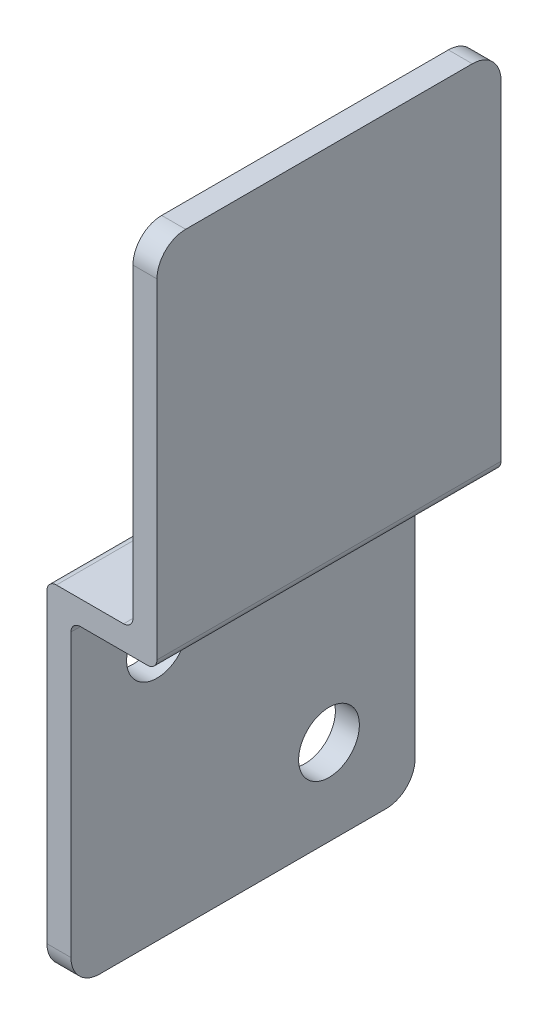
ISO-10303-21;
HEADER;
FILE_DESCRIPTION(('STEP AP214'),'2;1');
FILE_NAME('part.step','',(''),(''),'','','');
FILE_SCHEMA(('AUTOMOTIVE_DESIGN { 1 0 10303 214 1 1 1 1 }'));
ENDSEC;
DATA;
#1=APPLICATION_CONTEXT('core data for automotive mechanical design processes');
#2=APPLICATION_PROTOCOL_DEFINITION('international standard','automotive_design',2000,#1);
#3=PRODUCT_CONTEXT('',#1,'mechanical');
#4=PRODUCT('Part','Part','',(#3));
#5=PRODUCT_RELATED_PRODUCT_CATEGORY('part','',(#4));
#6=PRODUCT_DEFINITION_FORMATION('','',#4);
#7=PRODUCT_DEFINITION_CONTEXT('part definition',#1,'design');
#8=PRODUCT_DEFINITION('design','',#6,#7);
#9=PRODUCT_DEFINITION_SHAPE('','',#8);
#10=(LENGTH_UNIT() NAMED_UNIT(*) SI_UNIT(.MILLI.,.METRE.));
#11=(NAMED_UNIT(*) PLANE_ANGLE_UNIT() SI_UNIT($,.RADIAN.));
#12=(NAMED_UNIT(*) SI_UNIT($,.STERADIAN.) SOLID_ANGLE_UNIT());
#13=UNCERTAINTY_MEASURE_WITH_UNIT(LENGTH_MEASURE(1.E-05),#10,'distance_accuracy_value','');
#14=(GEOMETRIC_REPRESENTATION_CONTEXT(3) GLOBAL_UNCERTAINTY_ASSIGNED_CONTEXT((#13)) GLOBAL_UNIT_ASSIGNED_CONTEXT((#10,
#11,#12)) REPRESENTATION_CONTEXT('',''));
#15=CARTESIAN_POINT('',(0.,0.,0.));
#16=DIRECTION('',(0.,0.,1.));
#17=DIRECTION('',(1.,0.,0.));
#18=AXIS2_PLACEMENT_3D('',#15,#16,#17);
#19=CARTESIAN_POINT('',(0.,0.,-19.05));
#20=DIRECTION('',(0.,-1.,0.));
#21=DIRECTION('',(0.,0.,-1.));
#22=AXIS2_PLACEMENT_3D('',#19,#20,#21);
#23=PLANE('',#22);
#24=DIRECTION('',(0.,0.,-1.));
#25=VECTOR('',#24,1.);
#26=CARTESIAN_POINT('',(2.65684,0.,-19.05));
#27=LINE('',#26,#25);
#28=CARTESIAN_POINT('',(2.65684,0.,15.875));
#29=VERTEX_POINT('',#28);
#30=CARTESIAN_POINT('',(2.65684,0.,-15.875));
#31=VERTEX_POINT('',#30);
#32=EDGE_CURVE('E168',#29,#31,#27,.T.);
#33=ORIENTED_EDGE('',*,*,#32,.F.);
#34=DIRECTION('',(1.,0.,0.));
#35=VECTOR('',#34,1.);
#36=CARTESIAN_POINT('',(-15.880246624,0.,15.875));
#37=LINE('',#36,#35);
#38=CARTESIAN_POINT('',(0.,0.,15.875));
#39=VERTEX_POINT('',#38);
#40=EDGE_CURVE('E197',#39,#29,#37,.T.);
#41=ORIENTED_EDGE('',*,*,#40,.F.);
#42=DIRECTION('',(0.,0.,1.));
#43=VECTOR('',#42,1.);
#44=CARTESIAN_POINT('',(0.,0.,-19.05));
#45=LINE('',#44,#43);
#46=CARTESIAN_POINT('',(0.,0.,-15.875));
#47=VERTEX_POINT('',#46);
#48=EDGE_CURVE('E182',#47,#39,#45,.T.);
#49=ORIENTED_EDGE('',*,*,#48,.F.);
#50=DIRECTION('',(-1.,0.,0.));
#51=VECTOR('',#50,1.);
#52=CARTESIAN_POINT('',(28.062086624,0.,-15.875));
#53=LINE('',#52,#51);
#54=EDGE_CURVE('E194',#31,#47,#53,.T.);
#55=ORIENTED_EDGE('',*,*,#54,.F.);
#56=EDGE_LOOP('',(#33,#41,#49,#55));
#57=FACE_BOUND('',#56,.T.);
#58=ADVANCED_FACE('F17',(#57),#23,.T.);
#59=CARTESIAN_POINT('',(2.65684,9.525,-9.525));
#60=DIRECTION('',(1.,0.,0.));
#61=DIRECTION('',(0.,0.,-1.));
#62=AXIS2_PLACEMENT_3D('',#59,#60,#61);
#63=CYLINDRICAL_SURFACE('',#62,3.3655);
#64=CARTESIAN_POINT('',(0.,9.525,-9.525));
#65=DIRECTION('',(1.,0.,0.));
#66=DIRECTION('',(0.,0.,-1.));
#67=AXIS2_PLACEMENT_3D('',#64,#65,#66);
#68=CIRCLE('',#67,3.3655);
#69=CARTESIAN_POINT('',(0.,9.525,-12.8905));
#70=VERTEX_POINT('',#69);
#71=EDGE_CURVE('E188',#70,#70,#68,.T.);
#72=ORIENTED_EDGE('',*,*,#71,.F.);
#73=EDGE_LOOP('',(#72));
#74=FACE_BOUND('',#73,.T.);
#75=CARTESIAN_POINT('',(2.65684,9.525,-9.525));
#76=DIRECTION('',(1.,0.,0.));
#77=DIRECTION('',(0.,0.,-1.));
#78=AXIS2_PLACEMENT_3D('',#75,#76,#77);
#79=CIRCLE('',#78,3.3655);
#80=CARTESIAN_POINT('',(2.65684,9.525,-12.8905));
#81=VERTEX_POINT('',#80);
#82=EDGE_CURVE('E181',#81,#81,#79,.F.);
#83=ORIENTED_EDGE('',*,*,#82,.F.);
#84=EDGE_LOOP('',(#83));
#85=FACE_BOUND('',#84,.T.);
#86=ADVANCED_FACE('F449',(#74,#85),#63,.F.);
#87=CARTESIAN_POINT('',(2.65684,28.575,9.525));
#88=DIRECTION('',(1.,0.,0.));
#89=DIRECTION('',(0.,0.,-1.));
#90=AXIS2_PLACEMENT_3D('',#87,#88,#89);
#91=CYLINDRICAL_SURFACE('',#90,3.3655);
#92=CARTESIAN_POINT('',(0.,28.575,9.525));
#93=DIRECTION('',(1.,0.,0.));
#94=DIRECTION('',(0.,0.,-1.));
#95=AXIS2_PLACEMENT_3D('',#92,#93,#94);
#96=CIRCLE('',#95,3.3655);
#97=CARTESIAN_POINT('',(0.,28.575,6.1595));
#98=VERTEX_POINT('',#97);
#99=EDGE_CURVE('E225',#98,#98,#96,.T.);
#100=ORIENTED_EDGE('',*,*,#99,.F.);
#101=EDGE_LOOP('',(#100));
#102=FACE_BOUND('',#101,.T.);
#103=CARTESIAN_POINT('',(2.65684,28.575,9.525));
#104=DIRECTION('',(1.,0.,0.));
#105=DIRECTION('',(0.,0.,-1.));
#106=AXIS2_PLACEMENT_3D('',#103,#104,#105);
#107=CIRCLE('',#106,3.3655);
#108=CARTESIAN_POINT('',(2.65684,28.575,6.1595));
#109=VERTEX_POINT('',#108);
#110=EDGE_CURVE('E136',#109,#109,#107,.F.);
#111=ORIENTED_EDGE('',*,*,#110,.F.);
#112=EDGE_LOOP('',(#111));
#113=FACE_BOUND('',#112,.T.);
#114=ADVANCED_FACE('F440',(#102,#113),#91,.F.);
#115=CARTESIAN_POINT('',(8.4836,39.1414,-68.71716));
#116=DIRECTION('',(0.,0.,1.));
#117=DIRECTION('',(1.,0.,0.));
#118=AXIS2_PLACEMENT_3D('',#115,#116,#117);
#119=CYLINDRICAL_SURFACE('',#118,1.0414);
#120=DIRECTION('',(0.,0.,1.));
#121=VECTOR('',#120,1.);
#122=CARTESIAN_POINT('',(9.525,39.1414,-19.05));
#123=LINE('',#122,#121);
#124=CARTESIAN_POINT('',(9.525,39.1414,-19.05));
#125=VERTEX_POINT('',#124);
#126=CARTESIAN_POINT('',(9.525,39.1414,19.05));
#127=VERTEX_POINT('',#126);
#128=EDGE_CURVE('E130',#125,#127,#123,.T.);
#129=ORIENTED_EDGE('',*,*,#128,.F.);
#130=CARTESIAN_POINT('',(8.4836,39.1414,-19.05));
#131=DIRECTION('',(0.,0.,1.));
#132=DIRECTION('',(1.,0.,0.));
#133=AXIS2_PLACEMENT_3D('',#130,#131,#132);
#134=CIRCLE('',#133,1.0414);
#135=CARTESIAN_POINT('',(8.4836,38.1,-19.05));
#136=VERTEX_POINT('',#135);
#137=EDGE_CURVE('E20',#136,#125,#134,.T.);
#138=ORIENTED_EDGE('',*,*,#137,.F.);
#139=DIRECTION('',(0.,0.,1.));
#140=VECTOR('',#139,1.);
#141=CARTESIAN_POINT('',(8.4836,38.1,-19.05));
#142=LINE('',#141,#140);
#143=CARTESIAN_POINT('',(8.4836,38.1,19.05));
#144=VERTEX_POINT('',#143);
#145=EDGE_CURVE('E135',#144,#136,#142,.F.);
#146=ORIENTED_EDGE('',*,*,#145,.F.);
#147=CARTESIAN_POINT('',(8.4836,39.1414,19.05));
#148=DIRECTION('',(0.,0.,1.));
#149=DIRECTION('',(1.,0.,0.));
#150=AXIS2_PLACEMENT_3D('',#147,#148,#149);
#151=CIRCLE('',#150,1.0414);
#152=EDGE_CURVE('E128',#127,#144,#151,.F.);
#153=ORIENTED_EDGE('',*,*,#152,.F.);
#154=EDGE_LOOP('',(#129,#138,#146,#153));
#155=FACE_BOUND('',#154,.T.);
#156=ADVANCED_FACE('F131',(#155),#119,.F.);
#157=CARTESIAN_POINT('',(1.0414,37.0586,68.71716));
#158=DIRECTION('',(0.,0.,-1.));
#159=DIRECTION('',(-1.,0.,0.));
#160=AXIS2_PLACEMENT_3D('',#157,#158,#159);
#161=CYLINDRICAL_SURFACE('',#160,1.0414);
#162=DIRECTION('',(0.,0.,1.));
#163=VECTOR('',#162,1.);
#164=CARTESIAN_POINT('',(1.0414,38.1,-19.05));
#165=LINE('',#164,#163);
#166=CARTESIAN_POINT('',(1.0414,38.1,-19.05));
#167=VERTEX_POINT('',#166);
#168=CARTESIAN_POINT('',(1.0414,38.1,19.05));
#169=VERTEX_POINT('',#168);
#170=EDGE_CURVE('E163',#167,#169,#165,.T.);
#171=ORIENTED_EDGE('',*,*,#170,.F.);
#172=CARTESIAN_POINT('',(1.0414,37.0586,-19.05));
#173=DIRECTION('',(0.,0.,-1.));
#174=DIRECTION('',(-1.,0.,0.));
#175=AXIS2_PLACEMENT_3D('',#172,#173,#174);
#176=CIRCLE('',#175,1.0414);
#177=CARTESIAN_POINT('',(0.,37.0586,-19.05));
#178=VERTEX_POINT('',#177);
#179=EDGE_CURVE('E235',#167,#178,#176,.F.);
#180=ORIENTED_EDGE('',*,*,#179,.T.);
#181=DIRECTION('',(0.,0.,1.));
#182=VECTOR('',#181,1.);
#183=CARTESIAN_POINT('',(0.,37.0586,-19.05));
#184=LINE('',#183,#182);
#185=CARTESIAN_POINT('',(0.,37.0586,19.05));
#186=VERTEX_POINT('',#185);
#187=EDGE_CURVE('E184',#186,#178,#184,.F.);
#188=ORIENTED_EDGE('',*,*,#187,.F.);
#189=CARTESIAN_POINT('',(1.0414,37.0586,19.05));
#190=DIRECTION('',(0.,0.,-1.));
#191=DIRECTION('',(-1.,0.,0.));
#192=AXIS2_PLACEMENT_3D('',#189,#190,#191);
#193=CIRCLE('',#192,1.0414);
#194=EDGE_CURVE('E237',#186,#169,#193,.T.);
#195=ORIENTED_EDGE('',*,*,#194,.T.);
#196=EDGE_LOOP('',(#171,#180,#188,#195));
#197=FACE_BOUND('',#196,.T.);
#198=ADVANCED_FACE('F421',(#197),#161,.T.);
#199=CARTESIAN_POINT('',(3.69824,34.40176,-68.71716));
#200=DIRECTION('',(0.,0.,1.));
#201=DIRECTION('',(1.,0.,0.));
#202=AXIS2_PLACEMENT_3D('',#199,#200,#201);
#203=CYLINDRICAL_SURFACE('',#202,1.0414);
#204=DIRECTION('',(0.,0.,-1.));
#205=VECTOR('',#204,1.);
#206=CARTESIAN_POINT('',(2.65684,34.40176,-19.05));
#207=LINE('',#206,#205);
#208=CARTESIAN_POINT('',(2.65684,34.40176,-19.05));
#209=VERTEX_POINT('',#208);
#210=CARTESIAN_POINT('',(2.65684,34.40176,19.05));
#211=VERTEX_POINT('',#210);
#212=EDGE_CURVE('E178',#209,#211,#207,.F.);
#213=ORIENTED_EDGE('',*,*,#212,.F.);
#214=CARTESIAN_POINT('',(3.69824,34.40176,-19.05));
#215=DIRECTION('',(0.,0.,1.));
#216=DIRECTION('',(1.,0.,0.));
#217=AXIS2_PLACEMENT_3D('',#214,#215,#216);
#218=CIRCLE('',#217,1.0414);
#219=CARTESIAN_POINT('',(3.69824,35.44316,-19.05));
#220=VERTEX_POINT('',#219);
#221=EDGE_CURVE('E233',#220,#209,#218,.T.);
#222=ORIENTED_EDGE('',*,*,#221,.F.);
#223=DIRECTION('',(0.,0.,-1.));
#224=VECTOR('',#223,1.);
#225=CARTESIAN_POINT('',(3.69824,35.44316,-19.05));
#226=LINE('',#225,#224);
#227=CARTESIAN_POINT('',(3.69824,35.44316,19.05));
#228=VERTEX_POINT('',#227);
#229=EDGE_CURVE('E157',#228,#220,#226,.T.);
#230=ORIENTED_EDGE('',*,*,#229,.F.);
#231=CARTESIAN_POINT('',(3.69824,34.40176,19.05));
#232=DIRECTION('',(0.,0.,1.));
#233=DIRECTION('',(1.,0.,0.));
#234=AXIS2_PLACEMENT_3D('',#231,#232,#233);
#235=CIRCLE('',#234,1.0414);
#236=EDGE_CURVE('E196',#211,#228,#235,.F.);
#237=ORIENTED_EDGE('',*,*,#236,.F.);
#238=EDGE_LOOP('',(#213,#222,#230,#237));
#239=FACE_BOUND('',#238,.T.);
#240=ADVANCED_FACE('F411',(#239),#203,.F.);
#241=CARTESIAN_POINT('',(28.062086624,3.175,-15.875));
#242=DIRECTION('',(-1.,0.,0.));
#243=DIRECTION('',(0.,0.,1.));
#244=AXIS2_PLACEMENT_3D('',#241,#242,#243);
#245=CYLINDRICAL_SURFACE('',#244,3.175);
#246=ORIENTED_EDGE('',*,*,#54,.T.);
#247=CARTESIAN_POINT('',(0.,3.175,-15.875));
#248=DIRECTION('',(-1.,0.,0.));
#249=DIRECTION('',(0.,0.,1.));
#250=AXIS2_PLACEMENT_3D('',#247,#248,#249);
#251=CIRCLE('',#250,3.175);
#252=CARTESIAN_POINT('',(0.,3.175,-19.05));
#253=VERTEX_POINT('',#252);
#254=EDGE_CURVE('E185',#253,#47,#251,.T.);
#255=ORIENTED_EDGE('',*,*,#254,.F.);
#256=DIRECTION('',(1.,0.,0.));
#257=VECTOR('',#256,1.);
#258=CARTESIAN_POINT('',(0.,3.175,-19.05));
#259=LINE('',#258,#257);
#260=CARTESIAN_POINT('',(2.65684,3.175,-19.05));
#261=VERTEX_POINT('',#260);
#262=EDGE_CURVE('E153',#253,#261,#259,.T.);
#263=ORIENTED_EDGE('',*,*,#262,.T.);
#264=CARTESIAN_POINT('',(2.65684,3.175,-15.875));
#265=DIRECTION('',(-1.,0.,0.));
#266=DIRECTION('',(0.,0.,1.));
#267=AXIS2_PLACEMENT_3D('',#264,#265,#266);
#268=CIRCLE('',#267,3.175);
#269=EDGE_CURVE('E171',#31,#261,#268,.F.);
#270=ORIENTED_EDGE('',*,*,#269,.F.);
#271=EDGE_LOOP('',(#246,#255,#263,#270));
#272=FACE_BOUND('',#271,.T.);
#273=ADVANCED_FACE('F401',(#272),#245,.T.);
#274=CARTESIAN_POINT('',(0.,38.1,-19.05));
#275=DIRECTION('',(-1.,0.,0.));
#276=DIRECTION('',(0.,0.,1.));
#277=AXIS2_PLACEMENT_3D('',#274,#275,#276);
#278=PLANE('',#277);
#279=ORIENTED_EDGE('',*,*,#99,.T.);
#280=EDGE_LOOP('',(#279));
#281=FACE_BOUND('',#280,.T.);
#282=ORIENTED_EDGE('',*,*,#71,.T.);
#283=EDGE_LOOP('',(#282));
#284=FACE_BOUND('',#283,.T.);
#285=DIRECTION('',(0.,1.,0.));
#286=VECTOR('',#285,1.);
#287=CARTESIAN_POINT('',(0.,0.,19.05));
#288=LINE('',#287,#286);
#289=CARTESIAN_POINT('',(0.,3.175,19.05));
#290=VERTEX_POINT('',#289);
#291=EDGE_CURVE('E177',#186,#290,#288,.F.);
#292=ORIENTED_EDGE('',*,*,#291,.F.);
#293=ORIENTED_EDGE('',*,*,#187,.T.);
#294=DIRECTION('',(0.,1.,0.));
#295=VECTOR('',#294,1.);
#296=CARTESIAN_POINT('',(0.,0.,-19.05));
#297=LINE('',#296,#295);
#298=EDGE_CURVE('E154',#178,#253,#297,.F.);
#299=ORIENTED_EDGE('',*,*,#298,.T.);
#300=ORIENTED_EDGE('',*,*,#254,.T.);
#301=ORIENTED_EDGE('',*,*,#48,.T.);
#302=CARTESIAN_POINT('',(0.,3.175,15.875));
#303=DIRECTION('',(1.,0.,0.));
#304=DIRECTION('',(0.,0.,-1.));
#305=AXIS2_PLACEMENT_3D('',#302,#303,#304);
#306=CIRCLE('',#305,3.175);
#307=EDGE_CURVE('E199',#290,#39,#306,.T.);
#308=ORIENTED_EDGE('',*,*,#307,.F.);
#309=EDGE_LOOP('',(#292,#293,#299,#300,#301,#308));
#310=FACE_BOUND('',#309,.T.);
#311=ADVANCED_FACE('F391',(#281,#284,#310),#278,.T.);
#312=CARTESIAN_POINT('',(-15.880246624,3.175,15.875));
#313=DIRECTION('',(1.,0.,0.));
#314=DIRECTION('',(0.,0.,-1.));
#315=AXIS2_PLACEMENT_3D('',#312,#313,#314);
#316=CYLINDRICAL_SURFACE('',#315,3.175);
#317=ORIENTED_EDGE('',*,*,#40,.T.);
#318=CARTESIAN_POINT('',(2.65684,3.175,15.875));
#319=DIRECTION('',(1.,0.,0.));
#320=DIRECTION('',(0.,0.,-1.));
#321=AXIS2_PLACEMENT_3D('',#318,#319,#320);
#322=CIRCLE('',#321,3.175);
#323=CARTESIAN_POINT('',(2.65684,3.175,19.05));
#324=VERTEX_POINT('',#323);
#325=EDGE_CURVE('E172',#324,#29,#322,.T.);
#326=ORIENTED_EDGE('',*,*,#325,.F.);
#327=DIRECTION('',(1.,0.,0.));
#328=VECTOR('',#327,1.);
#329=CARTESIAN_POINT('',(0.,3.175,19.05));
#330=LINE('',#329,#328);
#331=EDGE_CURVE('E173',#290,#324,#330,.T.);
#332=ORIENTED_EDGE('',*,*,#331,.F.);
#333=ORIENTED_EDGE('',*,*,#307,.T.);
#334=EDGE_LOOP('',(#317,#326,#332,#333));
#335=FACE_BOUND('',#334,.T.);
#336=ADVANCED_FACE('F381',(#335),#316,.T.);
#337=CARTESIAN_POINT('',(2.65684,0.,-19.05));
#338=DIRECTION('',(1.,0.,0.));
#339=DIRECTION('',(0.,0.,-1.));
#340=AXIS2_PLACEMENT_3D('',#337,#338,#339);
#341=PLANE('',#340);
#342=ORIENTED_EDGE('',*,*,#110,.T.);
#343=EDGE_LOOP('',(#342));
#344=FACE_BOUND('',#343,.T.);
#345=ORIENTED_EDGE('',*,*,#82,.T.);
#346=EDGE_LOOP('',(#345));
#347=FACE_BOUND('',#346,.T.);
#348=DIRECTION('',(0.,1.,0.));
#349=VECTOR('',#348,1.);
#350=CARTESIAN_POINT('',(2.65684,0.,-19.05));
#351=LINE('',#350,#349);
#352=EDGE_CURVE('E147',#261,#209,#351,.T.);
#353=ORIENTED_EDGE('',*,*,#352,.T.);
#354=ORIENTED_EDGE('',*,*,#212,.T.);
#355=DIRECTION('',(0.,1.,0.));
#356=VECTOR('',#355,1.);
#357=CARTESIAN_POINT('',(2.65684,0.,19.05));
#358=LINE('',#357,#356);
#359=EDGE_CURVE('E176',#324,#211,#358,.T.);
#360=ORIENTED_EDGE('',*,*,#359,.F.);
#361=ORIENTED_EDGE('',*,*,#325,.T.);
#362=ORIENTED_EDGE('',*,*,#32,.T.);
#363=ORIENTED_EDGE('',*,*,#269,.T.);
#364=EDGE_LOOP('',(#353,#354,#360,#361,#362,#363));
#365=FACE_BOUND('',#364,.T.);
#366=ADVANCED_FACE('F372',(#344,#347,#365),#341,.T.);
#367=CARTESIAN_POINT('',(9.525,76.2,-19.05));
#368=DIRECTION('',(-1.,0.,0.));
#369=DIRECTION('',(0.,0.,1.));
#370=AXIS2_PLACEMENT_3D('',#367,#368,#369);
#371=PLANE('',#370);
#372=DIRECTION('',(0.,1.,0.));
#373=VECTOR('',#372,1.);
#374=CARTESIAN_POINT('',(9.525,0.,-19.05));
#375=LINE('',#374,#373);
#376=CARTESIAN_POINT('',(9.525,73.025,-19.05));
#377=VERTEX_POINT('',#376);
#378=EDGE_CURVE('E124',#377,#125,#375,.F.);
#379=ORIENTED_EDGE('',*,*,#378,.T.);
#380=ORIENTED_EDGE('',*,*,#128,.T.);
#381=DIRECTION('',(0.,1.,0.));
#382=VECTOR('',#381,1.);
#383=CARTESIAN_POINT('',(9.525,0.,19.05));
#384=LINE('',#383,#382);
#385=CARTESIAN_POINT('',(9.525,73.025,19.05));
#386=VERTEX_POINT('',#385);
#387=EDGE_CURVE('E242',#386,#127,#384,.F.);
#388=ORIENTED_EDGE('',*,*,#387,.F.);
#389=CARTESIAN_POINT('',(9.525,73.025,15.875));
#390=DIRECTION('',(-1.,0.,0.));
#391=DIRECTION('',(0.,0.,1.));
#392=AXIS2_PLACEMENT_3D('',#389,#390,#391);
#393=CIRCLE('',#392,3.175);
#394=CARTESIAN_POINT('',(9.525,76.2,15.875));
#395=VERTEX_POINT('',#394);
#396=EDGE_CURVE('E212',#395,#386,#393,.F.);
#397=ORIENTED_EDGE('',*,*,#396,.F.);
#398=DIRECTION('',(0.,0.,1.));
#399=VECTOR('',#398,1.);
#400=CARTESIAN_POINT('',(9.525,76.2,-19.05));
#401=LINE('',#400,#399);
#402=CARTESIAN_POINT('',(9.525,76.2,-15.875));
#403=VERTEX_POINT('',#402);
#404=EDGE_CURVE('E189',#403,#395,#401,.T.);
#405=ORIENTED_EDGE('',*,*,#404,.F.);
#406=CARTESIAN_POINT('',(9.525,73.025,-15.875));
#407=DIRECTION('',(1.,0.,0.));
#408=DIRECTION('',(0.,0.,-1.));
#409=AXIS2_PLACEMENT_3D('',#406,#407,#408);
#410=CIRCLE('',#409,3.175);
#411=EDGE_CURVE('E140',#377,#403,#410,.T.);
#412=ORIENTED_EDGE('',*,*,#411,.F.);
#413=EDGE_LOOP('',(#379,#380,#388,#397,#405,#412));
#414=FACE_BOUND('',#413,.T.);
#415=ADVANCED_FACE('F138',(#414),#371,.T.);
#416=CARTESIAN_POINT('',(9.525,38.1,-19.05));
#417=DIRECTION('',(0.,1.,0.));
#418=DIRECTION('',(0.,0.,1.));
#419=AXIS2_PLACEMENT_3D('',#416,#417,#418);
#420=PLANE('',#419);
#421=DIRECTION('',(1.,0.,0.));
#422=VECTOR('',#421,1.);
#423=CARTESIAN_POINT('',(0.,38.1,-19.05));
#424=LINE('',#423,#422);
#425=EDGE_CURVE('E127',#136,#167,#424,.F.);
#426=ORIENTED_EDGE('',*,*,#425,.T.);
#427=ORIENTED_EDGE('',*,*,#170,.T.);
#428=DIRECTION('',(1.,0.,0.));
#429=VECTOR('',#428,1.);
#430=CARTESIAN_POINT('',(0.,38.1,19.05));
#431=LINE('',#430,#429);
#432=EDGE_CURVE('E211',#144,#169,#431,.F.);
#433=ORIENTED_EDGE('',*,*,#432,.F.);
#434=ORIENTED_EDGE('',*,*,#145,.T.);
#435=EDGE_LOOP('',(#426,#427,#433,#434));
#436=FACE_BOUND('',#435,.T.);
#437=ADVANCED_FACE('F244',(#436),#420,.T.);
#438=CARTESIAN_POINT('',(2.65684,35.44316,-19.05));
#439=DIRECTION('',(0.,-1.,0.));
#440=DIRECTION('',(0.,0.,-1.));
#441=AXIS2_PLACEMENT_3D('',#438,#439,#440);
#442=PLANE('',#441);
#443=DIRECTION('',(1.,0.,0.));
#444=VECTOR('',#443,1.);
#445=CARTESIAN_POINT('',(0.,35.44316,-19.05));
#446=LINE('',#445,#444);
#447=CARTESIAN_POINT('',(11.14044,35.44316,-19.05));
#448=VERTEX_POINT('',#447);
#449=EDGE_CURVE('E142',#220,#448,#446,.T.);
#450=ORIENTED_EDGE('',*,*,#449,.T.);
#451=DIRECTION('',(0.,0.,-1.));
#452=VECTOR('',#451,1.);
#453=CARTESIAN_POINT('',(11.14044,35.44316,68.71716));
#454=LINE('',#453,#452);
#455=CARTESIAN_POINT('',(11.14044,35.44316,19.05));
#456=VERTEX_POINT('',#455);
#457=EDGE_CURVE('E158',#456,#448,#454,.T.);
#458=ORIENTED_EDGE('',*,*,#457,.F.);
#459=DIRECTION('',(1.,0.,0.));
#460=VECTOR('',#459,1.);
#461=CARTESIAN_POINT('',(0.,35.44316,19.05));
#462=LINE('',#461,#460);
#463=EDGE_CURVE('E252',#228,#456,#462,.T.);
#464=ORIENTED_EDGE('',*,*,#463,.F.);
#465=ORIENTED_EDGE('',*,*,#229,.T.);
#466=EDGE_LOOP('',(#450,#458,#464,#465));
#467=FACE_BOUND('',#466,.T.);
#468=ADVANCED_FACE('F277',(#467),#442,.T.);
#469=CARTESIAN_POINT('',(0.,0.,-19.05));
#470=DIRECTION('',(0.,0.,1.));
#471=DIRECTION('',(1.,0.,0.));
#472=AXIS2_PLACEMENT_3D('',#469,#470,#471);
#473=PLANE('',#472);
#474=ORIENTED_EDGE('',*,*,#137,.T.);
#475=ORIENTED_EDGE('',*,*,#378,.F.);
#476=DIRECTION('',(1.,0.,0.));
#477=VECTOR('',#476,1.);
#478=CARTESIAN_POINT('',(-15.880246624,73.025,-19.05));
#479=LINE('',#478,#477);
#480=CARTESIAN_POINT('',(12.18184,73.025,-19.05));
#481=VERTEX_POINT('',#480);
#482=EDGE_CURVE('E144',#481,#377,#479,.F.);
#483=ORIENTED_EDGE('',*,*,#482,.F.);
#484=DIRECTION('',(0.,1.,0.));
#485=VECTOR('',#484,1.);
#486=CARTESIAN_POINT('',(12.18184,35.44316,-19.05));
#487=LINE('',#486,#485);
#488=CARTESIAN_POINT('',(12.18184,36.48456,-19.05));
#489=VERTEX_POINT('',#488);
#490=EDGE_CURVE('E207',#489,#481,#487,.T.);
#491=ORIENTED_EDGE('',*,*,#490,.F.);
#492=CARTESIAN_POINT('',(11.14044,36.48456,-19.05));
#493=DIRECTION('',(0.,0.,-1.));
#494=DIRECTION('',(-1.,0.,0.));
#495=AXIS2_PLACEMENT_3D('',#492,#493,#494);
#496=CIRCLE('',#495,1.0414);
#497=EDGE_CURVE('E161',#448,#489,#496,.F.);
#498=ORIENTED_EDGE('',*,*,#497,.F.);
#499=ORIENTED_EDGE('',*,*,#449,.F.);
#500=ORIENTED_EDGE('',*,*,#221,.T.);
#501=ORIENTED_EDGE('',*,*,#352,.F.);
#502=ORIENTED_EDGE('',*,*,#262,.F.);
#503=ORIENTED_EDGE('',*,*,#298,.F.);
#504=ORIENTED_EDGE('',*,*,#179,.F.);
#505=ORIENTED_EDGE('',*,*,#425,.F.);
#506=EDGE_LOOP('',(#474,#475,#483,#491,#498,#499,#500,#501,#502,#503,#504,#505));
#507=FACE_BOUND('',#506,.T.);
#508=ADVANCED_FACE('F121',(#507),#473,.F.);
#509=CARTESIAN_POINT('',(-15.880246624,73.025,-15.875));
#510=DIRECTION('',(1.,0.,0.));
#511=DIRECTION('',(0.,0.,-1.));
#512=AXIS2_PLACEMENT_3D('',#509,#510,#511);
#513=CYLINDRICAL_SURFACE('',#512,3.175);
#514=DIRECTION('',(1.,0.,0.));
#515=VECTOR('',#514,1.);
#516=CARTESIAN_POINT('',(12.18184,76.2,-15.875));
#517=LINE('',#516,#515);
#518=CARTESIAN_POINT('',(12.18184,76.2,-15.875));
#519=VERTEX_POINT('',#518);
#520=EDGE_CURVE('E192',#519,#403,#517,.F.);
#521=ORIENTED_EDGE('',*,*,#520,.F.);
#522=CARTESIAN_POINT('',(12.18184,73.025,-15.875));
#523=DIRECTION('',(1.,0.,0.));
#524=DIRECTION('',(0.,0.,-1.));
#525=AXIS2_PLACEMENT_3D('',#522,#523,#524);
#526=CIRCLE('',#525,3.175);
#527=EDGE_CURVE('E204',#481,#519,#526,.T.);
#528=ORIENTED_EDGE('',*,*,#527,.F.);
#529=ORIENTED_EDGE('',*,*,#482,.T.);
#530=ORIENTED_EDGE('',*,*,#411,.T.);
#531=EDGE_LOOP('',(#521,#528,#529,#530));
#532=FACE_BOUND('',#531,.T.);
#533=ADVANCED_FACE('F265',(#532),#513,.T.);
#534=CARTESIAN_POINT('',(12.18184,76.2,-19.05));
#535=DIRECTION('',(0.,1.,0.));
#536=DIRECTION('',(0.,0.,1.));
#537=AXIS2_PLACEMENT_3D('',#534,#535,#536);
#538=PLANE('',#537);
#539=ORIENTED_EDGE('',*,*,#404,.T.);
#540=DIRECTION('',(-1.,0.,0.));
#541=VECTOR('',#540,1.);
#542=CARTESIAN_POINT('',(28.062086624,76.2,15.875));
#543=LINE('',#542,#541);
#544=CARTESIAN_POINT('',(12.18184,76.2,15.875));
#545=VERTEX_POINT('',#544);
#546=EDGE_CURVE('E191',#545,#395,#543,.T.);
#547=ORIENTED_EDGE('',*,*,#546,.F.);
#548=DIRECTION('',(0.,0.,-1.));
#549=VECTOR('',#548,1.);
#550=CARTESIAN_POINT('',(12.18184,76.2,-19.05));
#551=LINE('',#550,#549);
#552=EDGE_CURVE('E203',#519,#545,#551,.F.);
#553=ORIENTED_EDGE('',*,*,#552,.F.);
#554=ORIENTED_EDGE('',*,*,#520,.T.);
#555=EDGE_LOOP('',(#539,#547,#553,#554));
#556=FACE_BOUND('',#555,.T.);
#557=ADVANCED_FACE('F291',(#556),#538,.T.);
#558=CARTESIAN_POINT('',(28.062086624,73.025,15.875));
#559=DIRECTION('',(-1.,0.,0.));
#560=DIRECTION('',(0.,0.,1.));
#561=AXIS2_PLACEMENT_3D('',#558,#559,#560);
#562=CYLINDRICAL_SURFACE('',#561,3.175);
#563=ORIENTED_EDGE('',*,*,#546,.T.);
#564=ORIENTED_EDGE('',*,*,#396,.T.);
#565=DIRECTION('',(1.,0.,0.));
#566=VECTOR('',#565,1.);
#567=CARTESIAN_POINT('',(0.,73.025,19.05));
#568=LINE('',#567,#566);
#569=CARTESIAN_POINT('',(12.18184,73.025,19.05));
#570=VERTEX_POINT('',#569);
#571=EDGE_CURVE('E247',#570,#386,#568,.F.);
#572=ORIENTED_EDGE('',*,*,#571,.F.);
#573=CARTESIAN_POINT('',(12.18184,73.025,15.875));
#574=DIRECTION('',(-1.,0.,0.));
#575=DIRECTION('',(0.,0.,1.));
#576=AXIS2_PLACEMENT_3D('',#573,#574,#575);
#577=CIRCLE('',#576,3.175);
#578=EDGE_CURVE('E200',#545,#570,#577,.F.);
#579=ORIENTED_EDGE('',*,*,#578,.F.);
#580=EDGE_LOOP('',(#563,#564,#572,#579));
#581=FACE_BOUND('',#580,.T.);
#582=ADVANCED_FACE('F294',(#581),#562,.T.);
#583=CARTESIAN_POINT('',(0.,0.,19.05));
#584=DIRECTION('',(0.,0.,1.));
#585=DIRECTION('',(1.,0.,0.));
#586=AXIS2_PLACEMENT_3D('',#583,#584,#585);
#587=PLANE('',#586);
#588=ORIENTED_EDGE('',*,*,#432,.T.);
#589=ORIENTED_EDGE('',*,*,#194,.F.);
#590=ORIENTED_EDGE('',*,*,#291,.T.);
#591=ORIENTED_EDGE('',*,*,#331,.T.);
#592=ORIENTED_EDGE('',*,*,#359,.T.);
#593=ORIENTED_EDGE('',*,*,#236,.T.);
#594=ORIENTED_EDGE('',*,*,#463,.T.);
#595=CARTESIAN_POINT('',(11.14044,36.48456,19.05));
#596=DIRECTION('',(0.,0.,-1.));
#597=DIRECTION('',(-1.,0.,0.));
#598=AXIS2_PLACEMENT_3D('',#595,#596,#597);
#599=CIRCLE('',#598,1.0414);
#600=CARTESIAN_POINT('',(12.18184,36.48456,19.05));
#601=VERTEX_POINT('',#600);
#602=EDGE_CURVE('E35',#601,#456,#599,.T.);
#603=ORIENTED_EDGE('',*,*,#602,.F.);
#604=DIRECTION('',(0.,1.,0.));
#605=VECTOR('',#604,1.);
#606=CARTESIAN_POINT('',(12.18184,35.44316,19.05));
#607=LINE('',#606,#605);
#608=EDGE_CURVE('E26',#570,#601,#607,.F.);
#609=ORIENTED_EDGE('',*,*,#608,.F.);
#610=ORIENTED_EDGE('',*,*,#571,.T.);
#611=ORIENTED_EDGE('',*,*,#387,.T.);
#612=ORIENTED_EDGE('',*,*,#152,.T.);
#613=EDGE_LOOP('',(#588,#589,#590,#591,#592,#593,#594,#603,#609,#610,#611,#612));
#614=FACE_BOUND('',#613,.T.);
#615=ADVANCED_FACE('F239',(#614),#587,.T.);
#616=CARTESIAN_POINT('',(11.14044,36.48456,68.71716));
#617=DIRECTION('',(0.,0.,-1.));
#618=DIRECTION('',(-1.,0.,0.));
#619=AXIS2_PLACEMENT_3D('',#616,#617,#618);
#620=CYLINDRICAL_SURFACE('',#619,1.0414);
#621=ORIENTED_EDGE('',*,*,#457,.T.);
#622=ORIENTED_EDGE('',*,*,#497,.T.);
#623=DIRECTION('',(0.,0.,-1.));
#624=VECTOR('',#623,1.);
#625=CARTESIAN_POINT('',(12.18184,36.48456,-19.05));
#626=LINE('',#625,#624);
#627=EDGE_CURVE('E11',#601,#489,#626,.T.);
#628=ORIENTED_EDGE('',*,*,#627,.F.);
#629=ORIENTED_EDGE('',*,*,#602,.T.);
#630=EDGE_LOOP('',(#621,#622,#628,#629));
#631=FACE_BOUND('',#630,.T.);
#632=ADVANCED_FACE('F281',(#631),#620,.T.);
#633=CARTESIAN_POINT('',(12.18184,35.44316,-19.05));
#634=DIRECTION('',(1.,0.,0.));
#635=DIRECTION('',(0.,0.,-1.));
#636=AXIS2_PLACEMENT_3D('',#633,#634,#635);
#637=PLANE('',#636);
#638=ORIENTED_EDGE('',*,*,#608,.T.);
#639=ORIENTED_EDGE('',*,*,#627,.T.);
#640=ORIENTED_EDGE('',*,*,#490,.T.);
#641=ORIENTED_EDGE('',*,*,#527,.T.);
#642=ORIENTED_EDGE('',*,*,#552,.T.);
#643=ORIENTED_EDGE('',*,*,#578,.T.);
#644=EDGE_LOOP('',(#638,#639,#640,#641,#642,#643));
#645=FACE_BOUND('',#644,.T.);
#646=ADVANCED_FACE('F284',(#645),#637,.T.);
#647=CLOSED_SHELL('',(#58,#86,#114,#156,#198,#240,#273,#311,#336,#366,#415,#437,#468,#508,#533,
#557,#582,#615,#632,#646));
#648=MANIFOLD_SOLID_BREP('B1',#647);
#649=ADVANCED_BREP_SHAPE_REPRESENTATION('',(#18,#648),#14);
#650=SHAPE_DEFINITION_REPRESENTATION(#9,#649);
ENDSEC;
END-ISO-10303-21;
